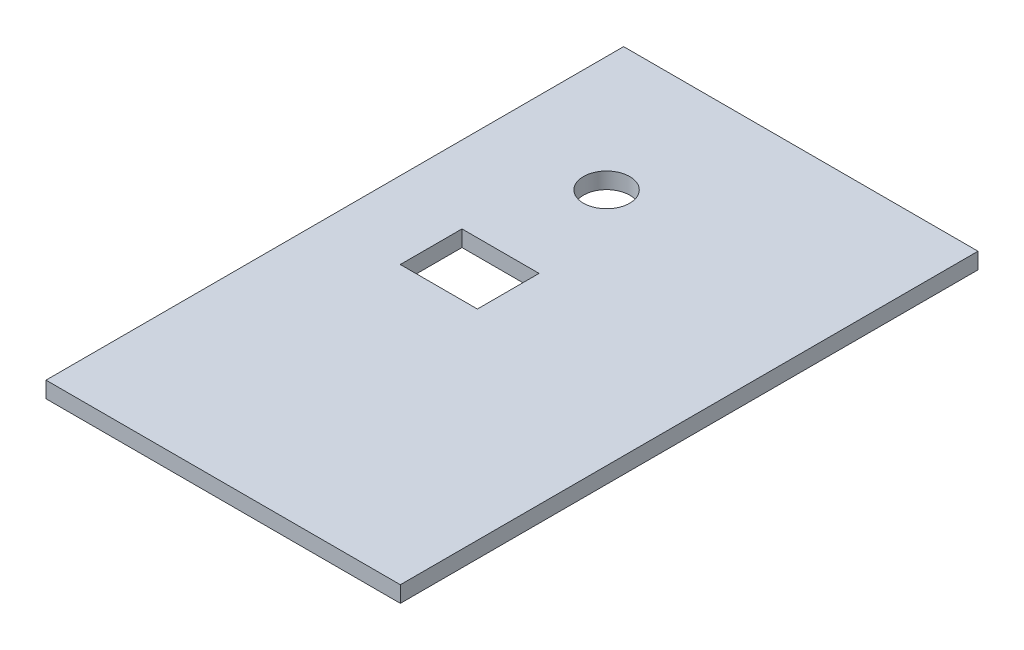
ISO-10303-21;
HEADER;
FILE_DESCRIPTION(('STEP AP214'),'2;1');
FILE_NAME('part.step','',(''),(''),'','','');
FILE_SCHEMA(('AUTOMOTIVE_DESIGN { 1 0 10303 214 1 1 1 1 }'));
ENDSEC;
DATA;
#1=APPLICATION_CONTEXT('core data for automotive mechanical design processes');
#2=APPLICATION_PROTOCOL_DEFINITION('international standard','automotive_design',2000,#1);
#3=PRODUCT_CONTEXT('',#1,'mechanical');
#4=PRODUCT('Part','Part','',(#3));
#5=PRODUCT_RELATED_PRODUCT_CATEGORY('part','',(#4));
#6=PRODUCT_DEFINITION_FORMATION('','',#4);
#7=PRODUCT_DEFINITION_CONTEXT('part definition',#1,'design');
#8=PRODUCT_DEFINITION('design','',#6,#7);
#9=PRODUCT_DEFINITION_SHAPE('','',#8);
#10=(LENGTH_UNIT() NAMED_UNIT(*) SI_UNIT(.MILLI.,.METRE.));
#11=(NAMED_UNIT(*) PLANE_ANGLE_UNIT() SI_UNIT($,.RADIAN.));
#12=(NAMED_UNIT(*) SI_UNIT($,.STERADIAN.) SOLID_ANGLE_UNIT());
#13=UNCERTAINTY_MEASURE_WITH_UNIT(LENGTH_MEASURE(1.E-05),#10,'distance_accuracy_value','');
#14=(GEOMETRIC_REPRESENTATION_CONTEXT(3) GLOBAL_UNCERTAINTY_ASSIGNED_CONTEXT((#13)) GLOBAL_UNIT_ASSIGNED_CONTEXT((#10,
#11,#12)) REPRESENTATION_CONTEXT('',''));
#15=CARTESIAN_POINT('',(0.,0.,0.));
#16=DIRECTION('',(0.,0.,1.));
#17=DIRECTION('',(1.,0.,0.));
#18=AXIS2_PLACEMENT_3D('',#15,#16,#17);
#19=CARTESIAN_POINT('',(0.,1.05,0.));
#20=DIRECTION('',(0.,1.,0.));
#21=DIRECTION('',(0.,0.,1.));
#22=AXIS2_PLACEMENT_3D('',#19,#20,#21);
#23=PLANE('',#22);
#24=DIRECTION('',(1.,0.,0.));
#25=VECTOR('',#24,1.);
#26=CARTESIAN_POINT('',(-6.5025,1.05,0.750000000000005));
#27=LINE('',#26,#25);
#28=CARTESIAN_POINT('',(-6.5025,1.05,0.750000000000005));
#29=VERTEX_POINT('',#28);
#30=CARTESIAN_POINT('',(-1.4975,1.05,0.750000000000005));
#31=VERTEX_POINT('',#30);
#32=EDGE_CURVE('E106',#29,#31,#27,.T.);
#33=ORIENTED_EDGE('',*,*,#32,.F.);
#34=DIRECTION('',(0.,0.,1.));
#35=VECTOR('',#34,1.);
#36=CARTESIAN_POINT('',(-6.5025,1.05,-3.25499999999999));
#37=LINE('',#36,#35);
#38=CARTESIAN_POINT('',(-6.5025,1.05,-3.25499999999999));
#39=VERTEX_POINT('',#38);
#40=EDGE_CURVE('E98',#39,#29,#37,.T.);
#41=ORIENTED_EDGE('',*,*,#40,.F.);
#42=DIRECTION('',(-1.,0.,0.));
#43=VECTOR('',#42,1.);
#44=CARTESIAN_POINT('',(-6.5025,1.05,-3.25499999999999));
#45=LINE('',#44,#43);
#46=CARTESIAN_POINT('',(-1.4975,1.05,-3.25499999999999));
#47=VERTEX_POINT('',#46);
#48=EDGE_CURVE('E121',#47,#39,#45,.T.);
#49=ORIENTED_EDGE('',*,*,#48,.F.);
#50=DIRECTION('',(0.,0.,-1.));
#51=VECTOR('',#50,1.);
#52=CARTESIAN_POINT('',(-1.4975,1.05,-3.25499999999999));
#53=LINE('',#52,#51);
#54=EDGE_CURVE('E119',#31,#47,#53,.T.);
#55=ORIENTED_EDGE('',*,*,#54,.F.);
#56=EDGE_LOOP('',(#33,#41,#49,#55));
#57=FACE_BOUND('',#56,.T.);
#58=DIRECTION('',(0.,0.,1.));
#59=VECTOR('',#58,1.);
#60=CARTESIAN_POINT('',(-11.5025,1.05,-18.75));
#61=LINE('',#60,#59);
#62=CARTESIAN_POINT('',(-11.5025,1.05,-18.75));
#63=VERTEX_POINT('',#62);
#64=CARTESIAN_POINT('',(-11.5025,1.05,18.75));
#65=VERTEX_POINT('',#64);
#66=EDGE_CURVE('E137',#63,#65,#61,.T.);
#67=ORIENTED_EDGE('',*,*,#66,.T.);
#68=DIRECTION('',(1.,0.,0.));
#69=VECTOR('',#68,1.);
#70=CARTESIAN_POINT('',(-11.5025,1.05,18.75));
#71=LINE('',#70,#69);
#72=CARTESIAN_POINT('',(11.5025,1.05,18.75));
#73=VERTEX_POINT('',#72);
#74=EDGE_CURVE('E140',#65,#73,#71,.T.);
#75=ORIENTED_EDGE('',*,*,#74,.T.);
#76=DIRECTION('',(0.,0.,-1.));
#77=VECTOR('',#76,1.);
#78=CARTESIAN_POINT('',(11.5025,1.05,-18.75));
#79=LINE('',#78,#77);
#80=CARTESIAN_POINT('',(11.5025,1.05,-18.75));
#81=VERTEX_POINT('',#80);
#82=EDGE_CURVE('E143',#73,#81,#79,.T.);
#83=ORIENTED_EDGE('',*,*,#82,.T.);
#84=DIRECTION('',(-1.,0.,0.));
#85=VECTOR('',#84,1.);
#86=CARTESIAN_POINT('',(-11.5025,1.05,-18.75));
#87=LINE('',#86,#85);
#88=EDGE_CURVE('E145',#81,#63,#87,.T.);
#89=ORIENTED_EDGE('',*,*,#88,.T.);
#90=EDGE_LOOP('',(#67,#75,#83,#89));
#91=FACE_BOUND('',#90,.T.);
#92=CARTESIAN_POINT('',(-4.0025,1.05,-10.14275));
#93=DIRECTION('',(0.,1.,0.));
#94=DIRECTION('',(0.,0.,1.));
#95=AXIS2_PLACEMENT_3D('',#92,#93,#94);
#96=CIRCLE('',#95,1.5025);
#97=CARTESIAN_POINT('',(-4.0025,1.05,-8.64025));
#98=VERTEX_POINT('',#97);
#99=EDGE_CURVE('E127',#98,#98,#96,.T.);
#100=ORIENTED_EDGE('',*,*,#99,.F.);
#101=EDGE_LOOP('',(#100));
#102=FACE_BOUND('',#101,.T.);
#103=ADVANCED_FACE('F33',(#57,#91,#102),#23,.T.);
#104=CARTESIAN_POINT('',(0.,0.,0.));
#105=DIRECTION('',(0.,1.,0.));
#106=DIRECTION('',(0.,0.,1.));
#107=AXIS2_PLACEMENT_3D('',#104,#105,#106);
#108=PLANE('',#107);
#109=DIRECTION('',(0.,0.,1.));
#110=VECTOR('',#109,1.);
#111=CARTESIAN_POINT('',(-11.5025,0.,-18.75));
#112=LINE('',#111,#110);
#113=CARTESIAN_POINT('',(-11.5025,0.,-18.75));
#114=VERTEX_POINT('',#113);
#115=CARTESIAN_POINT('',(-11.5025,0.,18.75));
#116=VERTEX_POINT('',#115);
#117=EDGE_CURVE('E114',#114,#116,#112,.T.);
#118=ORIENTED_EDGE('',*,*,#117,.F.);
#119=DIRECTION('',(-1.,0.,0.));
#120=VECTOR('',#119,1.);
#121=CARTESIAN_POINT('',(-11.5025,0.,-18.75));
#122=LINE('',#121,#120);
#123=CARTESIAN_POINT('',(11.5025,0.,-18.75));
#124=VERTEX_POINT('',#123);
#125=EDGE_CURVE('E141',#124,#114,#122,.T.);
#126=ORIENTED_EDGE('',*,*,#125,.F.);
#127=DIRECTION('',(0.,0.,-1.));
#128=VECTOR('',#127,1.);
#129=CARTESIAN_POINT('',(11.5025,0.,-18.75));
#130=LINE('',#129,#128);
#131=CARTESIAN_POINT('',(11.5025,0.,18.75));
#132=VERTEX_POINT('',#131);
#133=EDGE_CURVE('E152',#132,#124,#130,.T.);
#134=ORIENTED_EDGE('',*,*,#133,.F.);
#135=DIRECTION('',(1.,0.,0.));
#136=VECTOR('',#135,1.);
#137=CARTESIAN_POINT('',(-11.5025,0.,18.75));
#138=LINE('',#137,#136);
#139=EDGE_CURVE('E150',#116,#132,#138,.T.);
#140=ORIENTED_EDGE('',*,*,#139,.F.);
#141=EDGE_LOOP('',(#118,#126,#134,#140));
#142=FACE_BOUND('',#141,.T.);
#143=DIRECTION('',(0.,0.,1.));
#144=VECTOR('',#143,1.);
#145=CARTESIAN_POINT('',(-6.5025,0.,-3.25499999999999));
#146=LINE('',#145,#144);
#147=CARTESIAN_POINT('',(-6.5025,0.,-3.25499999999999));
#148=VERTEX_POINT('',#147);
#149=CARTESIAN_POINT('',(-6.5025,0.,0.750000000000005));
#150=VERTEX_POINT('',#149);
#151=EDGE_CURVE('E56',#148,#150,#146,.T.);
#152=ORIENTED_EDGE('',*,*,#151,.T.);
#153=DIRECTION('',(1.,0.,0.));
#154=VECTOR('',#153,1.);
#155=CARTESIAN_POINT('',(-6.5025,0.,0.750000000000005));
#156=LINE('',#155,#154);
#157=CARTESIAN_POINT('',(-1.4975,0.,0.750000000000005));
#158=VERTEX_POINT('',#157);
#159=EDGE_CURVE('E113',#150,#158,#156,.T.);
#160=ORIENTED_EDGE('',*,*,#159,.T.);
#161=DIRECTION('',(0.,0.,-1.));
#162=VECTOR('',#161,1.);
#163=CARTESIAN_POINT('',(-1.4975,0.,-3.25499999999999));
#164=LINE('',#163,#162);
#165=CARTESIAN_POINT('',(-1.4975,0.,-3.25499999999999));
#166=VERTEX_POINT('',#165);
#167=EDGE_CURVE('E129',#158,#166,#164,.T.);
#168=ORIENTED_EDGE('',*,*,#167,.T.);
#169=DIRECTION('',(-1.,0.,0.));
#170=VECTOR('',#169,1.);
#171=CARTESIAN_POINT('',(-6.5025,0.,-3.25499999999999));
#172=LINE('',#171,#170);
#173=EDGE_CURVE('E107',#166,#148,#172,.T.);
#174=ORIENTED_EDGE('',*,*,#173,.T.);
#175=EDGE_LOOP('',(#152,#160,#168,#174));
#176=FACE_BOUND('',#175,.T.);
#177=CARTESIAN_POINT('',(-4.0025,0.,-10.14275));
#178=DIRECTION('',(0.,1.,0.));
#179=DIRECTION('',(0.,0.,1.));
#180=AXIS2_PLACEMENT_3D('',#177,#178,#179);
#181=CIRCLE('',#180,1.5025);
#182=CARTESIAN_POINT('',(-4.0025,0.,-8.64025));
#183=VERTEX_POINT('',#182);
#184=EDGE_CURVE('E223',#183,#183,#181,.T.);
#185=ORIENTED_EDGE('',*,*,#184,.T.);
#186=EDGE_LOOP('',(#185));
#187=FACE_BOUND('',#186,.T.);
#188=ADVANCED_FACE('F170',(#142,#176,#187),#108,.F.);
#189=CARTESIAN_POINT('',(-11.5025,1.05,-18.75));
#190=DIRECTION('',(1.,0.,0.));
#191=DIRECTION('',(0.,0.,-1.));
#192=AXIS2_PLACEMENT_3D('',#189,#190,#191);
#193=PLANE('',#192);
#194=ORIENTED_EDGE('',*,*,#117,.T.);
#195=DIRECTION('',(0.,-1.,0.));
#196=VECTOR('',#195,1.);
#197=CARTESIAN_POINT('',(-11.5025,1.05,18.75));
#198=LINE('',#197,#196);
#199=EDGE_CURVE('E11',#65,#116,#198,.T.);
#200=ORIENTED_EDGE('',*,*,#199,.F.);
#201=ORIENTED_EDGE('',*,*,#66,.F.);
#202=DIRECTION('',(0.,-1.,0.));
#203=VECTOR('',#202,1.);
#204=CARTESIAN_POINT('',(-11.5025,1.05,-18.75));
#205=LINE('',#204,#203);
#206=EDGE_CURVE('E147',#63,#114,#205,.T.);
#207=ORIENTED_EDGE('',*,*,#206,.T.);
#208=EDGE_LOOP('',(#194,#200,#201,#207));
#209=FACE_BOUND('',#208,.T.);
#210=ADVANCED_FACE('F35',(#209),#193,.F.);
#211=CARTESIAN_POINT('',(-11.5025,1.05,18.75));
#212=DIRECTION('',(0.,0.,-1.));
#213=DIRECTION('',(-1.,0.,0.));
#214=AXIS2_PLACEMENT_3D('',#211,#212,#213);
#215=PLANE('',#214);
#216=ORIENTED_EDGE('',*,*,#139,.T.);
#217=DIRECTION('',(0.,-1.,0.));
#218=VECTOR('',#217,1.);
#219=CARTESIAN_POINT('',(11.5025,1.05,18.75));
#220=LINE('',#219,#218);
#221=EDGE_CURVE('E41',#73,#132,#220,.T.);
#222=ORIENTED_EDGE('',*,*,#221,.F.);
#223=ORIENTED_EDGE('',*,*,#74,.F.);
#224=ORIENTED_EDGE('',*,*,#199,.T.);
#225=EDGE_LOOP('',(#216,#222,#223,#224));
#226=FACE_BOUND('',#225,.T.);
#227=ADVANCED_FACE('F180',(#226),#215,.F.);
#228=CARTESIAN_POINT('',(11.5025,1.05,-18.75));
#229=DIRECTION('',(-1.,0.,0.));
#230=DIRECTION('',(0.,0.,1.));
#231=AXIS2_PLACEMENT_3D('',#228,#229,#230);
#232=PLANE('',#231);
#233=ORIENTED_EDGE('',*,*,#133,.T.);
#234=DIRECTION('',(0.,-1.,0.));
#235=VECTOR('',#234,1.);
#236=CARTESIAN_POINT('',(11.5025,1.05,-18.75));
#237=LINE('',#236,#235);
#238=EDGE_CURVE('E157',#81,#124,#237,.T.);
#239=ORIENTED_EDGE('',*,*,#238,.F.);
#240=ORIENTED_EDGE('',*,*,#82,.F.);
#241=ORIENTED_EDGE('',*,*,#221,.T.);
#242=EDGE_LOOP('',(#233,#239,#240,#241));
#243=FACE_BOUND('',#242,.T.);
#244=ADVANCED_FACE('F164',(#243),#232,.F.);
#245=CARTESIAN_POINT('',(-11.5025,1.05,-18.75));
#246=DIRECTION('',(0.,0.,1.));
#247=DIRECTION('',(1.,0.,0.));
#248=AXIS2_PLACEMENT_3D('',#245,#246,#247);
#249=PLANE('',#248);
#250=ORIENTED_EDGE('',*,*,#125,.T.);
#251=ORIENTED_EDGE('',*,*,#206,.F.);
#252=ORIENTED_EDGE('',*,*,#88,.F.);
#253=ORIENTED_EDGE('',*,*,#238,.T.);
#254=EDGE_LOOP('',(#250,#251,#252,#253));
#255=FACE_BOUND('',#254,.T.);
#256=ADVANCED_FACE('F174',(#255),#249,.F.);
#257=CARTESIAN_POINT('',(-6.5025,1.05,-3.25499999999999));
#258=DIRECTION('',(1.,0.,0.));
#259=DIRECTION('',(0.,0.,-1.));
#260=AXIS2_PLACEMENT_3D('',#257,#258,#259);
#261=PLANE('',#260);
#262=ORIENTED_EDGE('',*,*,#151,.F.);
#263=DIRECTION('',(0.,-1.,0.));
#264=VECTOR('',#263,1.);
#265=CARTESIAN_POINT('',(-6.5025,1.05,-3.25499999999999));
#266=LINE('',#265,#264);
#267=EDGE_CURVE('E102',#39,#148,#266,.T.);
#268=ORIENTED_EDGE('',*,*,#267,.F.);
#269=ORIENTED_EDGE('',*,*,#40,.T.);
#270=DIRECTION('',(0.,-1.,0.));
#271=VECTOR('',#270,1.);
#272=CARTESIAN_POINT('',(-6.5025,1.05,0.750000000000005));
#273=LINE('',#272,#271);
#274=EDGE_CURVE('E101',#29,#150,#273,.T.);
#275=ORIENTED_EDGE('',*,*,#274,.T.);
#276=EDGE_LOOP('',(#262,#268,#269,#275));
#277=FACE_BOUND('',#276,.T.);
#278=ADVANCED_FACE('F100',(#277),#261,.T.);
#279=CARTESIAN_POINT('',(-6.5025,1.05,0.750000000000005));
#280=DIRECTION('',(0.,0.,-1.));
#281=DIRECTION('',(-1.,0.,0.));
#282=AXIS2_PLACEMENT_3D('',#279,#280,#281);
#283=PLANE('',#282);
#284=ORIENTED_EDGE('',*,*,#159,.F.);
#285=ORIENTED_EDGE('',*,*,#274,.F.);
#286=ORIENTED_EDGE('',*,*,#32,.T.);
#287=DIRECTION('',(0.,-1.,0.));
#288=VECTOR('',#287,1.);
#289=CARTESIAN_POINT('',(-1.4975,1.05,0.750000000000005));
#290=LINE('',#289,#288);
#291=EDGE_CURVE('E115',#31,#158,#290,.T.);
#292=ORIENTED_EDGE('',*,*,#291,.T.);
#293=EDGE_LOOP('',(#284,#285,#286,#292));
#294=FACE_BOUND('',#293,.T.);
#295=ADVANCED_FACE('F110',(#294),#283,.T.);
#296=CARTESIAN_POINT('',(-1.4975,1.05,-3.25499999999999));
#297=DIRECTION('',(-1.,0.,0.));
#298=DIRECTION('',(0.,0.,1.));
#299=AXIS2_PLACEMENT_3D('',#296,#297,#298);
#300=PLANE('',#299);
#301=ORIENTED_EDGE('',*,*,#167,.F.);
#302=ORIENTED_EDGE('',*,*,#291,.F.);
#303=ORIENTED_EDGE('',*,*,#54,.T.);
#304=DIRECTION('',(0.,-1.,0.));
#305=VECTOR('',#304,1.);
#306=CARTESIAN_POINT('',(-1.4975,1.05,-3.25499999999999));
#307=LINE('',#306,#305);
#308=EDGE_CURVE('E48',#47,#166,#307,.T.);
#309=ORIENTED_EDGE('',*,*,#308,.T.);
#310=EDGE_LOOP('',(#301,#302,#303,#309));
#311=FACE_BOUND('',#310,.T.);
#312=ADVANCED_FACE('F203',(#311),#300,.T.);
#313=CARTESIAN_POINT('',(-6.5025,1.05,-3.25499999999999));
#314=DIRECTION('',(0.,0.,1.));
#315=DIRECTION('',(1.,0.,0.));
#316=AXIS2_PLACEMENT_3D('',#313,#314,#315);
#317=PLANE('',#316);
#318=ORIENTED_EDGE('',*,*,#173,.F.);
#319=ORIENTED_EDGE('',*,*,#308,.F.);
#320=ORIENTED_EDGE('',*,*,#48,.T.);
#321=ORIENTED_EDGE('',*,*,#267,.T.);
#322=EDGE_LOOP('',(#318,#319,#320,#321));
#323=FACE_BOUND('',#322,.T.);
#324=ADVANCED_FACE('F207',(#323),#317,.T.);
#325=CARTESIAN_POINT('',(-4.0025,1.05,-10.14275));
#326=DIRECTION('',(0.,-1.,0.));
#327=DIRECTION('',(0.,0.,-1.));
#328=AXIS2_PLACEMENT_3D('',#325,#326,#327);
#329=CYLINDRICAL_SURFACE('',#328,1.5025);
#330=ORIENTED_EDGE('',*,*,#99,.T.);
#331=EDGE_LOOP('',(#330));
#332=FACE_BOUND('',#331,.T.);
#333=ORIENTED_EDGE('',*,*,#184,.F.);
#334=EDGE_LOOP('',(#333));
#335=FACE_BOUND('',#334,.T.);
#336=ADVANCED_FACE('F213',(#332,#335),#329,.F.);
#337=CLOSED_SHELL('',(#103,#188,#210,#227,#244,#256,#278,#295,#312,#324,#336));
#338=MANIFOLD_SOLID_BREP('B2',#337);
#339=ADVANCED_BREP_SHAPE_REPRESENTATION('',(#18,#338),#14);
#340=SHAPE_DEFINITION_REPRESENTATION(#9,#339);
ENDSEC;
END-ISO-10303-21;
